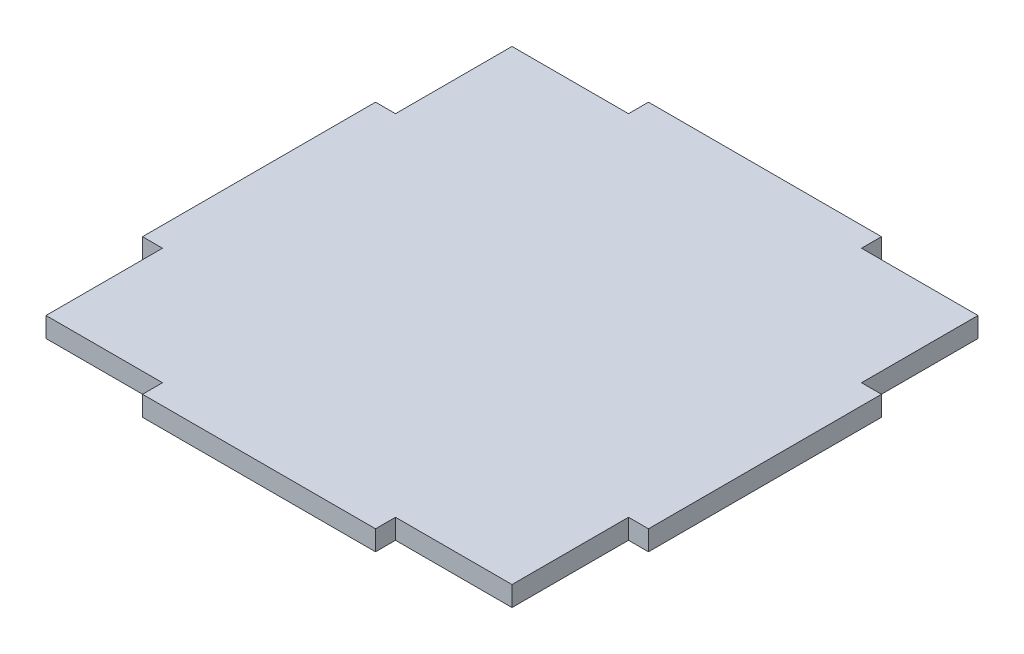
ISO-10303-21;
HEADER;
FILE_DESCRIPTION(('STEP AP214'),'2;1');
FILE_NAME('part.step','',(''),(''),'','','');
FILE_SCHEMA(('AUTOMOTIVE_DESIGN { 1 0 10303 214 1 1 1 1 }'));
ENDSEC;
DATA;
#1=APPLICATION_CONTEXT('core data for automotive mechanical design processes');
#2=APPLICATION_PROTOCOL_DEFINITION('international standard','automotive_design',2000,#1);
#3=PRODUCT_CONTEXT('',#1,'mechanical');
#4=PRODUCT('Part','Part','',(#3));
#5=PRODUCT_RELATED_PRODUCT_CATEGORY('part','',(#4));
#6=PRODUCT_DEFINITION_FORMATION('','',#4);
#7=PRODUCT_DEFINITION_CONTEXT('part definition',#1,'design');
#8=PRODUCT_DEFINITION('design','',#6,#7);
#9=PRODUCT_DEFINITION_SHAPE('','',#8);
#10=(LENGTH_UNIT() NAMED_UNIT(*) SI_UNIT(.MILLI.,.METRE.));
#11=(NAMED_UNIT(*) PLANE_ANGLE_UNIT() SI_UNIT($,.RADIAN.));
#12=(NAMED_UNIT(*) SI_UNIT($,.STERADIAN.) SOLID_ANGLE_UNIT());
#13=UNCERTAINTY_MEASURE_WITH_UNIT(LENGTH_MEASURE(1.E-05),#10,'distance_accuracy_value','');
#14=(GEOMETRIC_REPRESENTATION_CONTEXT(3) GLOBAL_UNCERTAINTY_ASSIGNED_CONTEXT((#13)) GLOBAL_UNIT_ASSIGNED_CONTEXT((#10,
#11,#12)) REPRESENTATION_CONTEXT('',''));
#15=CARTESIAN_POINT('',(0.,0.,0.));
#16=DIRECTION('',(0.,0.,1.));
#17=DIRECTION('',(1.,0.,0.));
#18=AXIS2_PLACEMENT_3D('',#15,#16,#17);
#19=CARTESIAN_POINT('',(35.,3.,-17.5));
#20=DIRECTION('',(-1.,0.,0.));
#21=DIRECTION('',(0.,0.,1.));
#22=AXIS2_PLACEMENT_3D('',#19,#20,#21);
#23=PLANE('',#22);
#24=DIRECTION('',(0.,0.,-1.));
#25=VECTOR('',#24,1.);
#26=CARTESIAN_POINT('',(35.,0.,-17.5));
#27=LINE('',#26,#25);
#28=CARTESIAN_POINT('',(35.,0.,-17.5));
#29=VERTEX_POINT('',#28);
#30=CARTESIAN_POINT('',(35.,0.,-35.));
#31=VERTEX_POINT('',#30);
#32=EDGE_CURVE('E201',#29,#31,#27,.T.);
#33=ORIENTED_EDGE('',*,*,#32,.T.);
#34=DIRECTION('',(0.,-1.,0.));
#35=VECTOR('',#34,1.);
#36=CARTESIAN_POINT('',(35.,3.,-35.));
#37=LINE('',#36,#35);
#38=CARTESIAN_POINT('',(35.,3.,-35.));
#39=VERTEX_POINT('',#38);
#40=EDGE_CURVE('E11',#39,#31,#37,.T.);
#41=ORIENTED_EDGE('',*,*,#40,.F.);
#42=DIRECTION('',(0.,0.,-1.));
#43=VECTOR('',#42,1.);
#44=CARTESIAN_POINT('',(35.,3.,-17.5));
#45=LINE('',#44,#43);
#46=CARTESIAN_POINT('',(35.,3.,-17.5));
#47=VERTEX_POINT('',#46);
#48=EDGE_CURVE('E239',#47,#39,#45,.T.);
#49=ORIENTED_EDGE('',*,*,#48,.F.);
#50=DIRECTION('',(0.,-1.,0.));
#51=VECTOR('',#50,1.);
#52=CARTESIAN_POINT('',(35.,3.,-17.5));
#53=LINE('',#52,#51);
#54=EDGE_CURVE('E197',#47,#29,#53,.T.);
#55=ORIENTED_EDGE('',*,*,#54,.T.);
#56=EDGE_LOOP('',(#33,#41,#49,#55));
#57=FACE_BOUND('',#56,.T.);
#58=ADVANCED_FACE('F33',(#57),#23,.F.);
#59=CARTESIAN_POINT('',(17.5,3.,-35.));
#60=DIRECTION('',(0.,0.,1.));
#61=DIRECTION('',(1.,0.,0.));
#62=AXIS2_PLACEMENT_3D('',#59,#60,#61);
#63=PLANE('',#62);
#64=DIRECTION('',(-1.,0.,0.));
#65=VECTOR('',#64,1.);
#66=CARTESIAN_POINT('',(17.5,0.,-35.));
#67=LINE('',#66,#65);
#68=CARTESIAN_POINT('',(17.5,0.,-35.));
#69=VERTEX_POINT('',#68);
#70=EDGE_CURVE('E204',#31,#69,#67,.T.);
#71=ORIENTED_EDGE('',*,*,#70,.T.);
#72=DIRECTION('',(0.,-1.,0.));
#73=VECTOR('',#72,1.);
#74=CARTESIAN_POINT('',(17.5,3.,-35.));
#75=LINE('',#74,#73);
#76=CARTESIAN_POINT('',(17.5,3.,-35.));
#77=VERTEX_POINT('',#76);
#78=EDGE_CURVE('E41',#77,#69,#75,.T.);
#79=ORIENTED_EDGE('',*,*,#78,.F.);
#80=DIRECTION('',(-1.,0.,0.));
#81=VECTOR('',#80,1.);
#82=CARTESIAN_POINT('',(17.5,3.,-35.));
#83=LINE('',#82,#81);
#84=EDGE_CURVE('E128',#39,#77,#83,.T.);
#85=ORIENTED_EDGE('',*,*,#84,.F.);
#86=ORIENTED_EDGE('',*,*,#40,.T.);
#87=EDGE_LOOP('',(#71,#79,#85,#86));
#88=FACE_BOUND('',#87,.T.);
#89=ADVANCED_FACE('F357',(#88),#63,.F.);
#90=CARTESIAN_POINT('',(17.5,3.,-38.));
#91=DIRECTION('',(-1.,0.,0.));
#92=DIRECTION('',(0.,0.,1.));
#93=AXIS2_PLACEMENT_3D('',#90,#91,#92);
#94=PLANE('',#93);
#95=DIRECTION('',(0.,0.,-1.));
#96=VECTOR('',#95,1.);
#97=CARTESIAN_POINT('',(17.5,0.,-38.));
#98=LINE('',#97,#96);
#99=CARTESIAN_POINT('',(17.5,0.,-38.));
#100=VERTEX_POINT('',#99);
#101=EDGE_CURVE('E206',#69,#100,#98,.T.);
#102=ORIENTED_EDGE('',*,*,#101,.T.);
#103=DIRECTION('',(0.,-1.,0.));
#104=VECTOR('',#103,1.);
#105=CARTESIAN_POINT('',(17.5,3.,-38.));
#106=LINE('',#105,#104);
#107=CARTESIAN_POINT('',(17.5,3.,-38.));
#108=VERTEX_POINT('',#107);
#109=EDGE_CURVE('E282',#108,#100,#106,.T.);
#110=ORIENTED_EDGE('',*,*,#109,.F.);
#111=DIRECTION('',(0.,0.,-1.));
#112=VECTOR('',#111,1.);
#113=CARTESIAN_POINT('',(17.5,3.,-38.));
#114=LINE('',#113,#112);
#115=EDGE_CURVE('E290',#77,#108,#114,.T.);
#116=ORIENTED_EDGE('',*,*,#115,.F.);
#117=ORIENTED_EDGE('',*,*,#78,.T.);
#118=EDGE_LOOP('',(#102,#110,#116,#117));
#119=FACE_BOUND('',#118,.T.);
#120=ADVANCED_FACE('F288',(#119),#94,.F.);
#121=CARTESIAN_POINT('',(-17.5,3.,-38.));
#122=DIRECTION('',(0.,0.,1.));
#123=DIRECTION('',(1.,0.,0.));
#124=AXIS2_PLACEMENT_3D('',#121,#122,#123);
#125=PLANE('',#124);
#126=DIRECTION('',(-1.,0.,0.));
#127=VECTOR('',#126,1.);
#128=CARTESIAN_POINT('',(-17.5,0.,-38.));
#129=LINE('',#128,#127);
#130=CARTESIAN_POINT('',(-17.5,0.,-38.));
#131=VERTEX_POINT('',#130);
#132=EDGE_CURVE('E208',#100,#131,#129,.T.);
#133=ORIENTED_EDGE('',*,*,#132,.T.);
#134=DIRECTION('',(0.,-1.,0.));
#135=VECTOR('',#134,1.);
#136=CARTESIAN_POINT('',(-17.5,3.,-38.));
#137=LINE('',#136,#135);
#138=CARTESIAN_POINT('',(-17.5,3.,-38.));
#139=VERTEX_POINT('',#138);
#140=EDGE_CURVE('E279',#139,#131,#137,.T.);
#141=ORIENTED_EDGE('',*,*,#140,.F.);
#142=DIRECTION('',(-1.,0.,0.));
#143=VECTOR('',#142,1.);
#144=CARTESIAN_POINT('',(-17.5,3.,-38.));
#145=LINE('',#144,#143);
#146=EDGE_CURVE('E308',#108,#139,#145,.T.);
#147=ORIENTED_EDGE('',*,*,#146,.F.);
#148=ORIENTED_EDGE('',*,*,#109,.T.);
#149=EDGE_LOOP('',(#133,#141,#147,#148));
#150=FACE_BOUND('',#149,.T.);
#151=ADVANCED_FACE('F299',(#150),#125,.F.);
#152=CARTESIAN_POINT('',(-17.5,3.,-38.));
#153=DIRECTION('',(1.,0.,0.));
#154=DIRECTION('',(0.,0.,-1.));
#155=AXIS2_PLACEMENT_3D('',#152,#153,#154);
#156=PLANE('',#155);
#157=DIRECTION('',(0.,0.,1.));
#158=VECTOR('',#157,1.);
#159=CARTESIAN_POINT('',(-17.5,0.,-38.));
#160=LINE('',#159,#158);
#161=CARTESIAN_POINT('',(-17.5,0.,-35.));
#162=VERTEX_POINT('',#161);
#163=EDGE_CURVE('E210',#131,#162,#160,.T.);
#164=ORIENTED_EDGE('',*,*,#163,.T.);
#165=DIRECTION('',(0.,-1.,0.));
#166=VECTOR('',#165,1.);
#167=CARTESIAN_POINT('',(-17.5,3.,-35.));
#168=LINE('',#167,#166);
#169=CARTESIAN_POINT('',(-17.5,3.,-35.));
#170=VERTEX_POINT('',#169);
#171=EDGE_CURVE('E276',#170,#162,#168,.T.);
#172=ORIENTED_EDGE('',*,*,#171,.F.);
#173=DIRECTION('',(0.,0.,1.));
#174=VECTOR('',#173,1.);
#175=CARTESIAN_POINT('',(-17.5,3.,-38.));
#176=LINE('',#175,#174);
#177=EDGE_CURVE('E305',#139,#170,#176,.T.);
#178=ORIENTED_EDGE('',*,*,#177,.F.);
#179=ORIENTED_EDGE('',*,*,#140,.T.);
#180=EDGE_LOOP('',(#164,#172,#178,#179));
#181=FACE_BOUND('',#180,.T.);
#182=ADVANCED_FACE('F303',(#181),#156,.F.);
#183=CARTESIAN_POINT('',(-35.,3.,-35.));
#184=DIRECTION('',(0.,0.,1.));
#185=DIRECTION('',(1.,0.,0.));
#186=AXIS2_PLACEMENT_3D('',#183,#184,#185);
#187=PLANE('',#186);
#188=DIRECTION('',(-1.,0.,0.));
#189=VECTOR('',#188,1.);
#190=CARTESIAN_POINT('',(-35.,0.,-35.));
#191=LINE('',#190,#189);
#192=CARTESIAN_POINT('',(-35.,0.,-35.));
#193=VERTEX_POINT('',#192);
#194=EDGE_CURVE('E212',#162,#193,#191,.T.);
#195=ORIENTED_EDGE('',*,*,#194,.T.);
#196=DIRECTION('',(0.,-1.,0.));
#197=VECTOR('',#196,1.);
#198=CARTESIAN_POINT('',(-35.,3.,-35.));
#199=LINE('',#198,#197);
#200=CARTESIAN_POINT('',(-35.,3.,-35.));
#201=VERTEX_POINT('',#200);
#202=EDGE_CURVE('E273',#201,#193,#199,.T.);
#203=ORIENTED_EDGE('',*,*,#202,.F.);
#204=DIRECTION('',(-1.,0.,0.));
#205=VECTOR('',#204,1.);
#206=CARTESIAN_POINT('',(-35.,3.,-35.));
#207=LINE('',#206,#205);
#208=EDGE_CURVE('E307',#170,#201,#207,.T.);
#209=ORIENTED_EDGE('',*,*,#208,.F.);
#210=ORIENTED_EDGE('',*,*,#171,.T.);
#211=EDGE_LOOP('',(#195,#203,#209,#210));
#212=FACE_BOUND('',#211,.T.);
#213=ADVANCED_FACE('F370',(#212),#187,.F.);
#214=CARTESIAN_POINT('',(-35.,3.,-17.5));
#215=DIRECTION('',(1.,0.,0.));
#216=DIRECTION('',(0.,0.,-1.));
#217=AXIS2_PLACEMENT_3D('',#214,#215,#216);
#218=PLANE('',#217);
#219=DIRECTION('',(0.,0.,1.));
#220=VECTOR('',#219,1.);
#221=CARTESIAN_POINT('',(-35.,0.,-17.5));
#222=LINE('',#221,#220);
#223=CARTESIAN_POINT('',(-35.,0.,-17.5));
#224=VERTEX_POINT('',#223);
#225=EDGE_CURVE('E214',#193,#224,#222,.T.);
#226=ORIENTED_EDGE('',*,*,#225,.T.);
#227=DIRECTION('',(0.,-1.,0.));
#228=VECTOR('',#227,1.);
#229=CARTESIAN_POINT('',(-35.,3.,-17.5));
#230=LINE('',#229,#228);
#231=CARTESIAN_POINT('',(-35.,3.,-17.5));
#232=VERTEX_POINT('',#231);
#233=EDGE_CURVE('E270',#232,#224,#230,.T.);
#234=ORIENTED_EDGE('',*,*,#233,.F.);
#235=DIRECTION('',(0.,0.,1.));
#236=VECTOR('',#235,1.);
#237=CARTESIAN_POINT('',(-35.,3.,-17.5));
#238=LINE('',#237,#236);
#239=EDGE_CURVE('E310',#201,#232,#238,.T.);
#240=ORIENTED_EDGE('',*,*,#239,.F.);
#241=ORIENTED_EDGE('',*,*,#202,.T.);
#242=EDGE_LOOP('',(#226,#234,#240,#241));
#243=FACE_BOUND('',#242,.T.);
#244=ADVANCED_FACE('F373',(#243),#218,.F.);
#245=CARTESIAN_POINT('',(-38.,3.,-17.5));
#246=DIRECTION('',(0.,0.,1.));
#247=DIRECTION('',(1.,0.,0.));
#248=AXIS2_PLACEMENT_3D('',#245,#246,#247);
#249=PLANE('',#248);
#250=DIRECTION('',(-1.,0.,0.));
#251=VECTOR('',#250,1.);
#252=CARTESIAN_POINT('',(-38.,0.,-17.5));
#253=LINE('',#252,#251);
#254=CARTESIAN_POINT('',(-38.,0.,-17.5));
#255=VERTEX_POINT('',#254);
#256=EDGE_CURVE('E216',#224,#255,#253,.T.);
#257=ORIENTED_EDGE('',*,*,#256,.T.);
#258=DIRECTION('',(0.,-1.,0.));
#259=VECTOR('',#258,1.);
#260=CARTESIAN_POINT('',(-38.,3.,-17.5));
#261=LINE('',#260,#259);
#262=CARTESIAN_POINT('',(-38.,3.,-17.5));
#263=VERTEX_POINT('',#262);
#264=EDGE_CURVE('E267',#263,#255,#261,.T.);
#265=ORIENTED_EDGE('',*,*,#264,.F.);
#266=DIRECTION('',(-1.,0.,0.));
#267=VECTOR('',#266,1.);
#268=CARTESIAN_POINT('',(-38.,3.,-17.5));
#269=LINE('',#268,#267);
#270=EDGE_CURVE('E316',#232,#263,#269,.T.);
#271=ORIENTED_EDGE('',*,*,#270,.F.);
#272=ORIENTED_EDGE('',*,*,#233,.T.);
#273=EDGE_LOOP('',(#257,#265,#271,#272));
#274=FACE_BOUND('',#273,.T.);
#275=ADVANCED_FACE('F377',(#274),#249,.F.);
#276=CARTESIAN_POINT('',(-38.,3.,17.5));
#277=DIRECTION('',(1.,0.,0.));
#278=DIRECTION('',(0.,0.,-1.));
#279=AXIS2_PLACEMENT_3D('',#276,#277,#278);
#280=PLANE('',#279);
#281=DIRECTION('',(0.,0.,1.));
#282=VECTOR('',#281,1.);
#283=CARTESIAN_POINT('',(-38.,0.,17.5));
#284=LINE('',#283,#282);
#285=CARTESIAN_POINT('',(-38.,0.,17.5));
#286=VERTEX_POINT('',#285);
#287=EDGE_CURVE('E218',#255,#286,#284,.T.);
#288=ORIENTED_EDGE('',*,*,#287,.T.);
#289=DIRECTION('',(0.,-1.,0.));
#290=VECTOR('',#289,1.);
#291=CARTESIAN_POINT('',(-38.,3.,17.5));
#292=LINE('',#291,#290);
#293=CARTESIAN_POINT('',(-38.,3.,17.5));
#294=VERTEX_POINT('',#293);
#295=EDGE_CURVE('E264',#294,#286,#292,.T.);
#296=ORIENTED_EDGE('',*,*,#295,.F.);
#297=DIRECTION('',(0.,0.,1.));
#298=VECTOR('',#297,1.);
#299=CARTESIAN_POINT('',(-38.,3.,17.5));
#300=LINE('',#299,#298);
#301=EDGE_CURVE('E318',#263,#294,#300,.T.);
#302=ORIENTED_EDGE('',*,*,#301,.F.);
#303=ORIENTED_EDGE('',*,*,#264,.T.);
#304=EDGE_LOOP('',(#288,#296,#302,#303));
#305=FACE_BOUND('',#304,.T.);
#306=ADVANCED_FACE('F381',(#305),#280,.F.);
#307=CARTESIAN_POINT('',(-38.,3.,17.5));
#308=DIRECTION('',(0.,0.,-1.));
#309=DIRECTION('',(-1.,0.,0.));
#310=AXIS2_PLACEMENT_3D('',#307,#308,#309);
#311=PLANE('',#310);
#312=DIRECTION('',(1.,0.,0.));
#313=VECTOR('',#312,1.);
#314=CARTESIAN_POINT('',(-38.,0.,17.5));
#315=LINE('',#314,#313);
#316=CARTESIAN_POINT('',(-35.,0.,17.5));
#317=VERTEX_POINT('',#316);
#318=EDGE_CURVE('E220',#286,#317,#315,.T.);
#319=ORIENTED_EDGE('',*,*,#318,.T.);
#320=DIRECTION('',(0.,-1.,0.));
#321=VECTOR('',#320,1.);
#322=CARTESIAN_POINT('',(-35.,3.,17.5));
#323=LINE('',#322,#321);
#324=CARTESIAN_POINT('',(-35.,3.,17.5));
#325=VERTEX_POINT('',#324);
#326=EDGE_CURVE('E261',#325,#317,#323,.T.);
#327=ORIENTED_EDGE('',*,*,#326,.F.);
#328=DIRECTION('',(1.,0.,0.));
#329=VECTOR('',#328,1.);
#330=CARTESIAN_POINT('',(-38.,3.,17.5));
#331=LINE('',#330,#329);
#332=EDGE_CURVE('E320',#294,#325,#331,.T.);
#333=ORIENTED_EDGE('',*,*,#332,.F.);
#334=ORIENTED_EDGE('',*,*,#295,.T.);
#335=EDGE_LOOP('',(#319,#327,#333,#334));
#336=FACE_BOUND('',#335,.T.);
#337=ADVANCED_FACE('F385',(#336),#311,.F.);
#338=CARTESIAN_POINT('',(-35.,3.,35.));
#339=DIRECTION('',(1.,0.,0.));
#340=DIRECTION('',(0.,0.,-1.));
#341=AXIS2_PLACEMENT_3D('',#338,#339,#340);
#342=PLANE('',#341);
#343=DIRECTION('',(0.,0.,1.));
#344=VECTOR('',#343,1.);
#345=CARTESIAN_POINT('',(-35.,0.,35.));
#346=LINE('',#345,#344);
#347=CARTESIAN_POINT('',(-35.,0.,35.));
#348=VERTEX_POINT('',#347);
#349=EDGE_CURVE('E222',#317,#348,#346,.T.);
#350=ORIENTED_EDGE('',*,*,#349,.T.);
#351=DIRECTION('',(0.,-1.,0.));
#352=VECTOR('',#351,1.);
#353=CARTESIAN_POINT('',(-35.,3.,35.));
#354=LINE('',#353,#352);
#355=CARTESIAN_POINT('',(-35.,3.,35.));
#356=VERTEX_POINT('',#355);
#357=EDGE_CURVE('E258',#356,#348,#354,.T.);
#358=ORIENTED_EDGE('',*,*,#357,.F.);
#359=DIRECTION('',(0.,0.,1.));
#360=VECTOR('',#359,1.);
#361=CARTESIAN_POINT('',(-35.,3.,35.));
#362=LINE('',#361,#360);
#363=EDGE_CURVE('E322',#325,#356,#362,.T.);
#364=ORIENTED_EDGE('',*,*,#363,.F.);
#365=ORIENTED_EDGE('',*,*,#326,.T.);
#366=EDGE_LOOP('',(#350,#358,#364,#365));
#367=FACE_BOUND('',#366,.T.);
#368=ADVANCED_FACE('F389',(#367),#342,.F.);
#369=CARTESIAN_POINT('',(-35.,3.,35.));
#370=DIRECTION('',(0.,0.,-1.));
#371=DIRECTION('',(-1.,0.,0.));
#372=AXIS2_PLACEMENT_3D('',#369,#370,#371);
#373=PLANE('',#372);
#374=DIRECTION('',(1.,0.,0.));
#375=VECTOR('',#374,1.);
#376=CARTESIAN_POINT('',(-35.,0.,35.));
#377=LINE('',#376,#375);
#378=CARTESIAN_POINT('',(-17.5,0.,35.));
#379=VERTEX_POINT('',#378);
#380=EDGE_CURVE('E224',#348,#379,#377,.T.);
#381=ORIENTED_EDGE('',*,*,#380,.T.);
#382=DIRECTION('',(0.,-1.,0.));
#383=VECTOR('',#382,1.);
#384=CARTESIAN_POINT('',(-17.5,3.,35.));
#385=LINE('',#384,#383);
#386=CARTESIAN_POINT('',(-17.5,3.,35.));
#387=VERTEX_POINT('',#386);
#388=EDGE_CURVE('E255',#387,#379,#385,.T.);
#389=ORIENTED_EDGE('',*,*,#388,.F.);
#390=DIRECTION('',(1.,0.,0.));
#391=VECTOR('',#390,1.);
#392=CARTESIAN_POINT('',(-35.,3.,35.));
#393=LINE('',#392,#391);
#394=EDGE_CURVE('E324',#356,#387,#393,.T.);
#395=ORIENTED_EDGE('',*,*,#394,.F.);
#396=ORIENTED_EDGE('',*,*,#357,.T.);
#397=EDGE_LOOP('',(#381,#389,#395,#396));
#398=FACE_BOUND('',#397,.T.);
#399=ADVANCED_FACE('F393',(#398),#373,.F.);
#400=CARTESIAN_POINT('',(-17.5,3.,38.));
#401=DIRECTION('',(1.,0.,0.));
#402=DIRECTION('',(0.,0.,-1.));
#403=AXIS2_PLACEMENT_3D('',#400,#401,#402);
#404=PLANE('',#403);
#405=DIRECTION('',(0.,0.,1.));
#406=VECTOR('',#405,1.);
#407=CARTESIAN_POINT('',(-17.5,0.,38.));
#408=LINE('',#407,#406);
#409=CARTESIAN_POINT('',(-17.5,0.,38.));
#410=VERTEX_POINT('',#409);
#411=EDGE_CURVE('E226',#379,#410,#408,.T.);
#412=ORIENTED_EDGE('',*,*,#411,.T.);
#413=DIRECTION('',(0.,-1.,0.));
#414=VECTOR('',#413,1.);
#415=CARTESIAN_POINT('',(-17.5,3.,38.));
#416=LINE('',#415,#414);
#417=CARTESIAN_POINT('',(-17.5,3.,38.));
#418=VERTEX_POINT('',#417);
#419=EDGE_CURVE('E252',#418,#410,#416,.T.);
#420=ORIENTED_EDGE('',*,*,#419,.F.);
#421=DIRECTION('',(0.,0.,1.));
#422=VECTOR('',#421,1.);
#423=CARTESIAN_POINT('',(-17.5,3.,38.));
#424=LINE('',#423,#422);
#425=EDGE_CURVE('E326',#387,#418,#424,.T.);
#426=ORIENTED_EDGE('',*,*,#425,.F.);
#427=ORIENTED_EDGE('',*,*,#388,.T.);
#428=EDGE_LOOP('',(#412,#420,#426,#427));
#429=FACE_BOUND('',#428,.T.);
#430=ADVANCED_FACE('F397',(#429),#404,.F.);
#431=CARTESIAN_POINT('',(-17.5,3.,38.));
#432=DIRECTION('',(0.,0.,-1.));
#433=DIRECTION('',(-1.,0.,0.));
#434=AXIS2_PLACEMENT_3D('',#431,#432,#433);
#435=PLANE('',#434);
#436=DIRECTION('',(1.,0.,0.));
#437=VECTOR('',#436,1.);
#438=CARTESIAN_POINT('',(-17.5,0.,38.));
#439=LINE('',#438,#437);
#440=CARTESIAN_POINT('',(17.5,0.,38.));
#441=VERTEX_POINT('',#440);
#442=EDGE_CURVE('E228',#410,#441,#439,.T.);
#443=ORIENTED_EDGE('',*,*,#442,.T.);
#444=DIRECTION('',(0.,-1.,0.));
#445=VECTOR('',#444,1.);
#446=CARTESIAN_POINT('',(17.5,3.,38.));
#447=LINE('',#446,#445);
#448=CARTESIAN_POINT('',(17.5,3.,38.));
#449=VERTEX_POINT('',#448);
#450=EDGE_CURVE('E249',#449,#441,#447,.T.);
#451=ORIENTED_EDGE('',*,*,#450,.F.);
#452=DIRECTION('',(1.,0.,0.));
#453=VECTOR('',#452,1.);
#454=CARTESIAN_POINT('',(-17.5,3.,38.));
#455=LINE('',#454,#453);
#456=EDGE_CURVE('E328',#418,#449,#455,.T.);
#457=ORIENTED_EDGE('',*,*,#456,.F.);
#458=ORIENTED_EDGE('',*,*,#419,.T.);
#459=EDGE_LOOP('',(#443,#451,#457,#458));
#460=FACE_BOUND('',#459,.T.);
#461=ADVANCED_FACE('F401',(#460),#435,.F.);
#462=CARTESIAN_POINT('',(17.5,3.,38.));
#463=DIRECTION('',(-1.,0.,0.));
#464=DIRECTION('',(0.,0.,1.));
#465=AXIS2_PLACEMENT_3D('',#462,#463,#464);
#466=PLANE('',#465);
#467=DIRECTION('',(0.,0.,-1.));
#468=VECTOR('',#467,1.);
#469=CARTESIAN_POINT('',(17.5,0.,38.));
#470=LINE('',#469,#468);
#471=CARTESIAN_POINT('',(17.5,0.,35.));
#472=VERTEX_POINT('',#471);
#473=EDGE_CURVE('E230',#441,#472,#470,.T.);
#474=ORIENTED_EDGE('',*,*,#473,.T.);
#475=DIRECTION('',(0.,-1.,0.));
#476=VECTOR('',#475,1.);
#477=CARTESIAN_POINT('',(17.5,3.,35.));
#478=LINE('',#477,#476);
#479=CARTESIAN_POINT('',(17.5,3.,35.));
#480=VERTEX_POINT('',#479);
#481=EDGE_CURVE('E246',#480,#472,#478,.T.);
#482=ORIENTED_EDGE('',*,*,#481,.F.);
#483=DIRECTION('',(0.,0.,-1.));
#484=VECTOR('',#483,1.);
#485=CARTESIAN_POINT('',(17.5,3.,38.));
#486=LINE('',#485,#484);
#487=EDGE_CURVE('E330',#449,#480,#486,.T.);
#488=ORIENTED_EDGE('',*,*,#487,.F.);
#489=ORIENTED_EDGE('',*,*,#450,.T.);
#490=EDGE_LOOP('',(#474,#482,#488,#489));
#491=FACE_BOUND('',#490,.T.);
#492=ADVANCED_FACE('F405',(#491),#466,.F.);
#493=CARTESIAN_POINT('',(17.5,3.,35.));
#494=DIRECTION('',(0.,0.,-1.));
#495=DIRECTION('',(-1.,0.,0.));
#496=AXIS2_PLACEMENT_3D('',#493,#494,#495);
#497=PLANE('',#496);
#498=DIRECTION('',(1.,0.,0.));
#499=VECTOR('',#498,1.);
#500=CARTESIAN_POINT('',(17.5,0.,35.));
#501=LINE('',#500,#499);
#502=CARTESIAN_POINT('',(35.,0.,35.));
#503=VERTEX_POINT('',#502);
#504=EDGE_CURVE('E232',#472,#503,#501,.T.);
#505=ORIENTED_EDGE('',*,*,#504,.T.);
#506=DIRECTION('',(0.,-1.,0.));
#507=VECTOR('',#506,1.);
#508=CARTESIAN_POINT('',(35.,3.,35.));
#509=LINE('',#508,#507);
#510=CARTESIAN_POINT('',(35.,3.,35.));
#511=VERTEX_POINT('',#510);
#512=EDGE_CURVE('E243',#511,#503,#509,.T.);
#513=ORIENTED_EDGE('',*,*,#512,.F.);
#514=DIRECTION('',(1.,0.,0.));
#515=VECTOR('',#514,1.);
#516=CARTESIAN_POINT('',(17.5,3.,35.));
#517=LINE('',#516,#515);
#518=EDGE_CURVE('E332',#480,#511,#517,.T.);
#519=ORIENTED_EDGE('',*,*,#518,.F.);
#520=ORIENTED_EDGE('',*,*,#481,.T.);
#521=EDGE_LOOP('',(#505,#513,#519,#520));
#522=FACE_BOUND('',#521,.T.);
#523=ADVANCED_FACE('F338',(#522),#497,.F.);
#524=CARTESIAN_POINT('',(35.,3.,35.));
#525=DIRECTION('',(-1.,0.,0.));
#526=DIRECTION('',(0.,0.,1.));
#527=AXIS2_PLACEMENT_3D('',#524,#525,#526);
#528=PLANE('',#527);
#529=DIRECTION('',(0.,0.,-1.));
#530=VECTOR('',#529,1.);
#531=CARTESIAN_POINT('',(35.,0.,35.));
#532=LINE('',#531,#530);
#533=CARTESIAN_POINT('',(35.,0.,17.5));
#534=VERTEX_POINT('',#533);
#535=EDGE_CURVE('E234',#503,#534,#532,.T.);
#536=ORIENTED_EDGE('',*,*,#535,.T.);
#537=DIRECTION('',(0.,-1.,0.));
#538=VECTOR('',#537,1.);
#539=CARTESIAN_POINT('',(35.,3.,17.5));
#540=LINE('',#539,#538);
#541=CARTESIAN_POINT('',(35.,3.,17.5));
#542=VERTEX_POINT('',#541);
#543=EDGE_CURVE('E192',#542,#534,#540,.T.);
#544=ORIENTED_EDGE('',*,*,#543,.F.);
#545=DIRECTION('',(0.,0.,-1.));
#546=VECTOR('',#545,1.);
#547=CARTESIAN_POINT('',(35.,3.,35.));
#548=LINE('',#547,#546);
#549=EDGE_CURVE('E183',#511,#542,#548,.T.);
#550=ORIENTED_EDGE('',*,*,#549,.F.);
#551=ORIENTED_EDGE('',*,*,#512,.T.);
#552=EDGE_LOOP('',(#536,#544,#550,#551));
#553=FACE_BOUND('',#552,.T.);
#554=ADVANCED_FACE('F342',(#553),#528,.F.);
#555=CARTESIAN_POINT('',(38.,3.,17.5));
#556=DIRECTION('',(0.,0.,-1.));
#557=DIRECTION('',(-1.,0.,0.));
#558=AXIS2_PLACEMENT_3D('',#555,#556,#557);
#559=PLANE('',#558);
#560=DIRECTION('',(1.,0.,0.));
#561=VECTOR('',#560,1.);
#562=CARTESIAN_POINT('',(38.,0.,17.5));
#563=LINE('',#562,#561);
#564=CARTESIAN_POINT('',(38.,0.,17.5));
#565=VERTEX_POINT('',#564);
#566=EDGE_CURVE('E191',#534,#565,#563,.T.);
#567=ORIENTED_EDGE('',*,*,#566,.T.);
#568=DIRECTION('',(0.,-1.,0.));
#569=VECTOR('',#568,1.);
#570=CARTESIAN_POINT('',(38.,3.,17.5));
#571=LINE('',#570,#569);
#572=CARTESIAN_POINT('',(38.,3.,17.5));
#573=VERTEX_POINT('',#572);
#574=EDGE_CURVE('E188',#573,#565,#571,.T.);
#575=ORIENTED_EDGE('',*,*,#574,.F.);
#576=DIRECTION('',(1.,0.,0.));
#577=VECTOR('',#576,1.);
#578=CARTESIAN_POINT('',(38.,3.,17.5));
#579=LINE('',#578,#577);
#580=EDGE_CURVE('E177',#542,#573,#579,.T.);
#581=ORIENTED_EDGE('',*,*,#580,.F.);
#582=ORIENTED_EDGE('',*,*,#543,.T.);
#583=EDGE_LOOP('',(#567,#575,#581,#582));
#584=FACE_BOUND('',#583,.T.);
#585=ADVANCED_FACE('F189',(#584),#559,.F.);
#586=CARTESIAN_POINT('',(38.,3.,-17.5));
#587=DIRECTION('',(-1.,0.,0.));
#588=DIRECTION('',(0.,0.,1.));
#589=AXIS2_PLACEMENT_3D('',#586,#587,#588);
#590=PLANE('',#589);
#591=DIRECTION('',(0.,0.,-1.));
#592=VECTOR('',#591,1.);
#593=CARTESIAN_POINT('',(38.,0.,-17.5));
#594=LINE('',#593,#592);
#595=CARTESIAN_POINT('',(38.,0.,-17.5));
#596=VERTEX_POINT('',#595);
#597=EDGE_CURVE('E114',#565,#596,#594,.T.);
#598=ORIENTED_EDGE('',*,*,#597,.T.);
#599=DIRECTION('',(0.,-1.,0.));
#600=VECTOR('',#599,1.);
#601=CARTESIAN_POINT('',(38.,3.,-17.5));
#602=LINE('',#601,#600);
#603=CARTESIAN_POINT('',(38.,3.,-17.5));
#604=VERTEX_POINT('',#603);
#605=EDGE_CURVE('E193',#604,#596,#602,.T.);
#606=ORIENTED_EDGE('',*,*,#605,.F.);
#607=DIRECTION('',(0.,0.,-1.));
#608=VECTOR('',#607,1.);
#609=CARTESIAN_POINT('',(38.,3.,-17.5));
#610=LINE('',#609,#608);
#611=EDGE_CURVE('E181',#573,#604,#610,.T.);
#612=ORIENTED_EDGE('',*,*,#611,.F.);
#613=ORIENTED_EDGE('',*,*,#574,.T.);
#614=EDGE_LOOP('',(#598,#606,#612,#613));
#615=FACE_BOUND('',#614,.T.);
#616=ADVANCED_FACE('F195',(#615),#590,.F.);
#617=CARTESIAN_POINT('',(38.,3.,-17.5));
#618=DIRECTION('',(0.,0.,1.));
#619=DIRECTION('',(1.,0.,0.));
#620=AXIS2_PLACEMENT_3D('',#617,#618,#619);
#621=PLANE('',#620);
#622=DIRECTION('',(-1.,0.,0.));
#623=VECTOR('',#622,1.);
#624=CARTESIAN_POINT('',(38.,0.,-17.5));
#625=LINE('',#624,#623);
#626=EDGE_CURVE('E120',#596,#29,#625,.T.);
#627=ORIENTED_EDGE('',*,*,#626,.T.);
#628=ORIENTED_EDGE('',*,*,#54,.F.);
#629=DIRECTION('',(-1.,0.,0.));
#630=VECTOR('',#629,1.);
#631=CARTESIAN_POINT('',(38.,3.,-17.5));
#632=LINE('',#631,#630);
#633=EDGE_CURVE('E49',#604,#47,#632,.T.);
#634=ORIENTED_EDGE('',*,*,#633,.F.);
#635=ORIENTED_EDGE('',*,*,#605,.T.);
#636=EDGE_LOOP('',(#627,#628,#634,#635));
#637=FACE_BOUND('',#636,.T.);
#638=ADVANCED_FACE('F346',(#637),#621,.F.);
#639=CARTESIAN_POINT('',(0.,3.,0.));
#640=DIRECTION('',(0.,-1.,0.));
#641=DIRECTION('',(0.,0.,-1.));
#642=AXIS2_PLACEMENT_3D('',#639,#640,#641);
#643=PLANE('',#642);
#644=ORIENTED_EDGE('',*,*,#48,.T.);
#645=ORIENTED_EDGE('',*,*,#84,.T.);
#646=ORIENTED_EDGE('',*,*,#115,.T.);
#647=ORIENTED_EDGE('',*,*,#146,.T.);
#648=ORIENTED_EDGE('',*,*,#177,.T.);
#649=ORIENTED_EDGE('',*,*,#208,.T.);
#650=ORIENTED_EDGE('',*,*,#239,.T.);
#651=ORIENTED_EDGE('',*,*,#270,.T.);
#652=ORIENTED_EDGE('',*,*,#301,.T.);
#653=ORIENTED_EDGE('',*,*,#332,.T.);
#654=ORIENTED_EDGE('',*,*,#363,.T.);
#655=ORIENTED_EDGE('',*,*,#394,.T.);
#656=ORIENTED_EDGE('',*,*,#425,.T.);
#657=ORIENTED_EDGE('',*,*,#456,.T.);
#658=ORIENTED_EDGE('',*,*,#487,.T.);
#659=ORIENTED_EDGE('',*,*,#518,.T.);
#660=ORIENTED_EDGE('',*,*,#549,.T.);
#661=ORIENTED_EDGE('',*,*,#580,.T.);
#662=ORIENTED_EDGE('',*,*,#611,.T.);
#663=ORIENTED_EDGE('',*,*,#633,.T.);
#664=EDGE_LOOP('',(#644,#645,#646,#647,#648,#649,#650,#651,#652,#653,#654,#655,#656,#657,#658,
#659,#660,#661,#662,#663));
#665=FACE_BOUND('',#664,.T.);
#666=ADVANCED_FACE('F179',(#665),#643,.F.);
#667=CARTESIAN_POINT('',(0.,0.,0.));
#668=DIRECTION('',(0.,-1.,0.));
#669=DIRECTION('',(0.,0.,-1.));
#670=AXIS2_PLACEMENT_3D('',#667,#668,#669);
#671=PLANE('',#670);
#672=ORIENTED_EDGE('',*,*,#32,.F.);
#673=ORIENTED_EDGE('',*,*,#626,.F.);
#674=ORIENTED_EDGE('',*,*,#597,.F.);
#675=ORIENTED_EDGE('',*,*,#566,.F.);
#676=ORIENTED_EDGE('',*,*,#535,.F.);
#677=ORIENTED_EDGE('',*,*,#504,.F.);
#678=ORIENTED_EDGE('',*,*,#473,.F.);
#679=ORIENTED_EDGE('',*,*,#442,.F.);
#680=ORIENTED_EDGE('',*,*,#411,.F.);
#681=ORIENTED_EDGE('',*,*,#380,.F.);
#682=ORIENTED_EDGE('',*,*,#349,.F.);
#683=ORIENTED_EDGE('',*,*,#318,.F.);
#684=ORIENTED_EDGE('',*,*,#287,.F.);
#685=ORIENTED_EDGE('',*,*,#256,.F.);
#686=ORIENTED_EDGE('',*,*,#225,.F.);
#687=ORIENTED_EDGE('',*,*,#194,.F.);
#688=ORIENTED_EDGE('',*,*,#163,.F.);
#689=ORIENTED_EDGE('',*,*,#132,.F.);
#690=ORIENTED_EDGE('',*,*,#101,.F.);
#691=ORIENTED_EDGE('',*,*,#70,.F.);
#692=EDGE_LOOP('',(#672,#673,#674,#675,#676,#677,#678,#679,#680,#681,#682,#683,#684,#685,#686,
#687,#688,#689,#690,#691));
#693=FACE_BOUND('',#692,.T.);
#694=ADVANCED_FACE('F294',(#693),#671,.T.);
#695=CLOSED_SHELL('',(#58,#89,#120,#151,#182,#213,#244,#275,#306,#337,#368,#399,#430,#461,#492,
#523,#554,#585,#616,#638,#666,#694));
#696=MANIFOLD_SOLID_BREP('B2',#695);
#697=ADVANCED_BREP_SHAPE_REPRESENTATION('',(#18,#696),#14);
#698=SHAPE_DEFINITION_REPRESENTATION(#9,#697);
ENDSEC;
END-ISO-10303-21;
